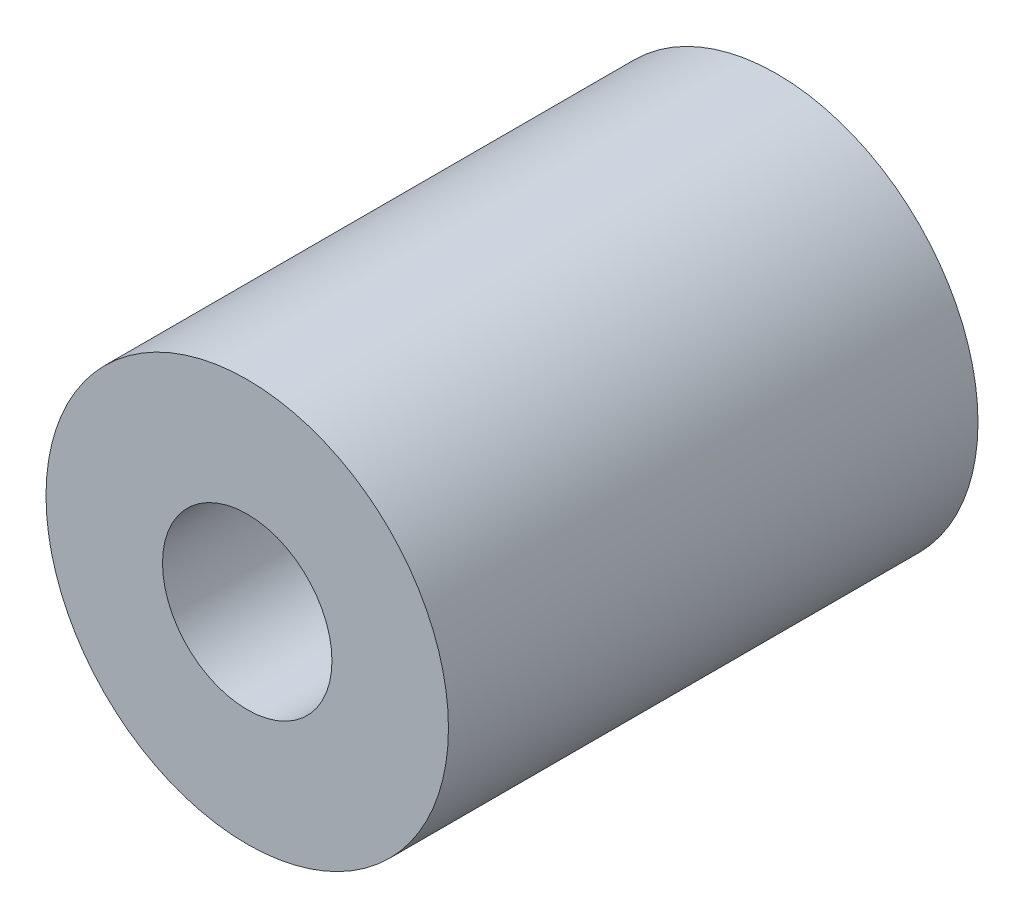
ISO-10303-21;
HEADER;
FILE_DESCRIPTION(('STEP AP214'),'2;1');
FILE_NAME('part.step','',(''),(''),'','','');
FILE_SCHEMA(('AUTOMOTIVE_DESIGN { 1 0 10303 214 1 1 1 1 }'));
ENDSEC;
DATA;
#1=APPLICATION_CONTEXT('core data for automotive mechanical design processes');
#2=APPLICATION_PROTOCOL_DEFINITION('international standard','automotive_design',2000,#1);
#3=PRODUCT_CONTEXT('',#1,'mechanical');
#4=PRODUCT('Part','Part','',(#3));
#5=PRODUCT_RELATED_PRODUCT_CATEGORY('part','',(#4));
#6=PRODUCT_DEFINITION_FORMATION('','',#4);
#7=PRODUCT_DEFINITION_CONTEXT('part definition',#1,'design');
#8=PRODUCT_DEFINITION('design','',#6,#7);
#9=PRODUCT_DEFINITION_SHAPE('','',#8);
#10=(LENGTH_UNIT() NAMED_UNIT(*) SI_UNIT(.MILLI.,.METRE.));
#11=(NAMED_UNIT(*) PLANE_ANGLE_UNIT() SI_UNIT($,.RADIAN.));
#12=(NAMED_UNIT(*) SI_UNIT($,.STERADIAN.) SOLID_ANGLE_UNIT());
#13=UNCERTAINTY_MEASURE_WITH_UNIT(LENGTH_MEASURE(1.E-05),#10,'distance_accuracy_value','');
#14=(GEOMETRIC_REPRESENTATION_CONTEXT(3) GLOBAL_UNCERTAINTY_ASSIGNED_CONTEXT((#13)) GLOBAL_UNIT_ASSIGNED_CONTEXT((#10,
#11,#12)) REPRESENTATION_CONTEXT('',''));
#15=CARTESIAN_POINT('',(0.,0.,0.));
#16=DIRECTION('',(0.,0.,1.));
#17=DIRECTION('',(1.,0.,0.));
#18=AXIS2_PLACEMENT_3D('',#15,#16,#17);
#19=CARTESIAN_POINT('',(0.,0.,25.));
#20=DIRECTION('',(0.,0.,-1.));
#21=DIRECTION('',(-1.,0.,0.));
#22=AXIS2_PLACEMENT_3D('',#19,#20,#21);
#23=CYLINDRICAL_SURFACE('',#22,9.5);
#24=CARTESIAN_POINT('',(0.,0.,25.));
#25=DIRECTION('',(0.,0.,1.));
#26=DIRECTION('',(1.,0.,0.));
#27=AXIS2_PLACEMENT_3D('',#24,#25,#26);
#28=CIRCLE('',#27,9.5);
#29=CARTESIAN_POINT('',(9.5,0.,25.));
#30=VERTEX_POINT('',#29);
#31=EDGE_CURVE('E10',#30,#30,#28,.T.);
#32=ORIENTED_EDGE('',*,*,#31,.F.);
#33=EDGE_LOOP('',(#32));
#34=FACE_BOUND('',#33,.T.);
#35=CARTESIAN_POINT('',(0.,0.,0.));
#36=DIRECTION('',(0.,0.,1.));
#37=DIRECTION('',(1.,0.,0.));
#38=AXIS2_PLACEMENT_3D('',#35,#36,#37);
#39=CIRCLE('',#38,9.5);
#40=CARTESIAN_POINT('',(9.5,0.,0.));
#41=VERTEX_POINT('',#40);
#42=EDGE_CURVE('E40',#41,#41,#39,.T.);
#43=ORIENTED_EDGE('',*,*,#42,.T.);
#44=EDGE_LOOP('',(#43));
#45=FACE_BOUND('',#44,.T.);
#46=ADVANCED_FACE('F37',(#34,#45),#23,.T.);
#47=CARTESIAN_POINT('',(0.,0.,25.));
#48=DIRECTION('',(0.,0.,1.));
#49=DIRECTION('',(1.,0.,0.));
#50=AXIS2_PLACEMENT_3D('',#47,#48,#49);
#51=PLANE('',#50);
#52=CARTESIAN_POINT('',(0.,0.,25.));
#53=DIRECTION('',(0.,0.,1.));
#54=DIRECTION('',(1.,0.,0.));
#55=AXIS2_PLACEMENT_3D('',#52,#53,#54);
#56=CIRCLE('',#55,4.);
#57=CARTESIAN_POINT('',(4.,0.,25.));
#58=VERTEX_POINT('',#57);
#59=EDGE_CURVE('E51',#58,#58,#56,.T.);
#60=ORIENTED_EDGE('',*,*,#59,.F.);
#61=EDGE_LOOP('',(#60));
#62=FACE_BOUND('',#61,.T.);
#63=ORIENTED_EDGE('',*,*,#31,.T.);
#64=EDGE_LOOP('',(#63));
#65=FACE_BOUND('',#64,.T.);
#66=ADVANCED_FACE('F80',(#62,#65),#51,.T.);
#67=CARTESIAN_POINT('',(0.,0.,0.));
#68=DIRECTION('',(0.,0.,1.));
#69=DIRECTION('',(1.,0.,0.));
#70=AXIS2_PLACEMENT_3D('',#67,#68,#69);
#71=PLANE('',#70);
#72=CARTESIAN_POINT('',(0.,0.,0.));
#73=DIRECTION('',(0.,0.,-1.));
#74=DIRECTION('',(-1.,0.,0.));
#75=AXIS2_PLACEMENT_3D('',#72,#73,#74);
#76=CIRCLE('',#75,2.5);
#77=CARTESIAN_POINT('',(-2.5,0.,0.));
#78=VERTEX_POINT('',#77);
#79=EDGE_CURVE('E59',#78,#78,#76,.T.);
#80=ORIENTED_EDGE('',*,*,#79,.F.);
#81=EDGE_LOOP('',(#80));
#82=FACE_BOUND('',#81,.T.);
#83=ORIENTED_EDGE('',*,*,#42,.F.);
#84=EDGE_LOOP('',(#83));
#85=FACE_BOUND('',#84,.T.);
#86=ADVANCED_FACE('F76',(#82,#85),#71,.F.);
#87=CARTESIAN_POINT('',(0.,0.,15.));
#88=DIRECTION('',(0.,0.,1.));
#89=DIRECTION('',(1.,0.,0.));
#90=AXIS2_PLACEMENT_3D('',#87,#88,#89);
#91=CYLINDRICAL_SURFACE('',#90,4.);
#92=CARTESIAN_POINT('',(0.,0.,15.));
#93=DIRECTION('',(0.,0.,1.));
#94=DIRECTION('',(1.,0.,0.));
#95=AXIS2_PLACEMENT_3D('',#92,#93,#94);
#96=CIRCLE('',#95,4.);
#97=CARTESIAN_POINT('',(4.,0.,15.));
#98=VERTEX_POINT('',#97);
#99=EDGE_CURVE('E49',#98,#98,#96,.T.);
#100=ORIENTED_EDGE('',*,*,#99,.F.);
#101=EDGE_LOOP('',(#100));
#102=FACE_BOUND('',#101,.T.);
#103=ORIENTED_EDGE('',*,*,#59,.T.);
#104=EDGE_LOOP('',(#103));
#105=FACE_BOUND('',#104,.T.);
#106=ADVANCED_FACE('F79',(#102,#105),#91,.F.);
#107=CARTESIAN_POINT('',(0.,0.,15.));
#108=DIRECTION('',(0.,0.,1.));
#109=DIRECTION('',(1.,0.,0.));
#110=AXIS2_PLACEMENT_3D('',#107,#108,#109);
#111=PLANE('',#110);
#112=ORIENTED_EDGE('',*,*,#99,.T.);
#113=EDGE_LOOP('',(#112));
#114=FACE_BOUND('',#113,.T.);
#115=ADVANCED_FACE('F72',(#114),#111,.T.);
#116=CARTESIAN_POINT('',(0.,0.,10.));
#117=DIRECTION('',(0.,0.,-1.));
#118=DIRECTION('',(-1.,0.,0.));
#119=AXIS2_PLACEMENT_3D('',#116,#117,#118);
#120=CYLINDRICAL_SURFACE('',#119,2.5);
#121=CARTESIAN_POINT('',(0.,0.,10.));
#122=DIRECTION('',(0.,0.,-1.));
#123=DIRECTION('',(-1.,0.,0.));
#124=AXIS2_PLACEMENT_3D('',#121,#122,#123);
#125=CIRCLE('',#124,2.5);
#126=CARTESIAN_POINT('',(-2.5,0.,10.));
#127=VERTEX_POINT('',#126);
#128=EDGE_CURVE('E55',#127,#127,#125,.T.);
#129=ORIENTED_EDGE('',*,*,#128,.F.);
#130=EDGE_LOOP('',(#129));
#131=FACE_BOUND('',#130,.T.);
#132=ORIENTED_EDGE('',*,*,#79,.T.);
#133=EDGE_LOOP('',(#132));
#134=FACE_BOUND('',#133,.T.);
#135=ADVANCED_FACE('F69',(#131,#134),#120,.F.);
#136=CARTESIAN_POINT('',(0.,0.,10.));
#137=DIRECTION('',(0.,0.,-1.));
#138=DIRECTION('',(-1.,0.,0.));
#139=AXIS2_PLACEMENT_3D('',#136,#137,#138);
#140=PLANE('',#139);
#141=ORIENTED_EDGE('',*,*,#128,.T.);
#142=EDGE_LOOP('',(#141));
#143=FACE_BOUND('',#142,.T.);
#144=ADVANCED_FACE('F67',(#143),#140,.T.);
#145=CLOSED_SHELL('',(#46,#66,#86,#106,#115,#135,#144));
#146=MANIFOLD_SOLID_BREP('B2',#145);
#147=ADVANCED_BREP_SHAPE_REPRESENTATION('',(#18,#146),#14);
#148=SHAPE_DEFINITION_REPRESENTATION(#9,#147);
ENDSEC;
END-ISO-10303-21;
